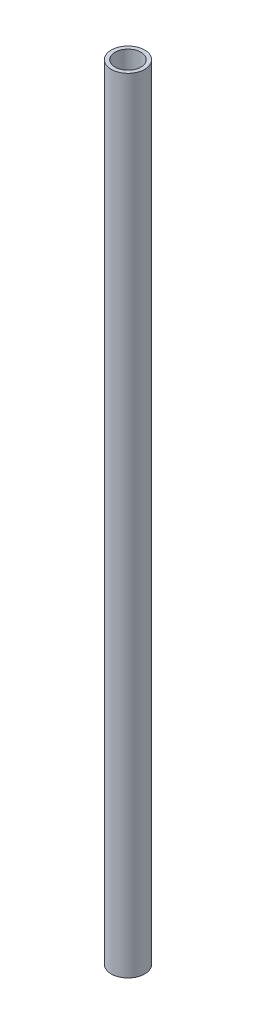
ISO-10303-21;
HEADER;
FILE_DESCRIPTION(('STEP AP214'),'2;1');
FILE_NAME('part.step','',(''),(''),'','','');
FILE_SCHEMA(('AUTOMOTIVE_DESIGN { 1 0 10303 214 1 1 1 1 }'));
ENDSEC;
DATA;
#1=APPLICATION_CONTEXT('core data for automotive mechanical design processes');
#2=APPLICATION_PROTOCOL_DEFINITION('international standard','automotive_design',2000,#1);
#3=PRODUCT_CONTEXT('',#1,'mechanical');
#4=PRODUCT('Part','Part','',(#3));
#5=PRODUCT_RELATED_PRODUCT_CATEGORY('part','',(#4));
#6=PRODUCT_DEFINITION_FORMATION('','',#4);
#7=PRODUCT_DEFINITION_CONTEXT('part definition',#1,'design');
#8=PRODUCT_DEFINITION('design','',#6,#7);
#9=PRODUCT_DEFINITION_SHAPE('','',#8);
#10=(LENGTH_UNIT() NAMED_UNIT(*) SI_UNIT(.MILLI.,.METRE.));
#11=(NAMED_UNIT(*) PLANE_ANGLE_UNIT() SI_UNIT($,.RADIAN.));
#12=(NAMED_UNIT(*) SI_UNIT($,.STERADIAN.) SOLID_ANGLE_UNIT());
#13=UNCERTAINTY_MEASURE_WITH_UNIT(LENGTH_MEASURE(1.E-05),#10,'distance_accuracy_value','');
#14=(GEOMETRIC_REPRESENTATION_CONTEXT(3) GLOBAL_UNCERTAINTY_ASSIGNED_CONTEXT((#13)) GLOBAL_UNIT_ASSIGNED_CONTEXT((#10,
#11,#12)) REPRESENTATION_CONTEXT('',''));
#15=CARTESIAN_POINT('',(0.,0.,0.));
#16=DIRECTION('',(0.,0.,1.));
#17=DIRECTION('',(1.,0.,0.));
#18=AXIS2_PLACEMENT_3D('',#15,#16,#17);
#19=CARTESIAN_POINT('',(0.,278.5,0.));
#20=DIRECTION('',(0.,1.,0.));
#21=DIRECTION('',(0.,0.,1.));
#22=AXIS2_PLACEMENT_3D('',#19,#20,#21);
#23=PLANE('',#22);
#24=CARTESIAN_POINT('',(0.,278.5,0.));
#25=DIRECTION('',(0.,1.,0.));
#26=DIRECTION('',(0.,0.,1.));
#27=AXIS2_PLACEMENT_3D('',#24,#25,#26);
#28=CIRCLE('',#27,5.95);
#29=CARTESIAN_POINT('',(0.,278.5,5.95));
#30=VERTEX_POINT('',#29);
#31=EDGE_CURVE('E10',#30,#30,#28,.T.);
#32=ORIENTED_EDGE('',*,*,#31,.T.);
#33=EDGE_LOOP('',(#32));
#34=FACE_BOUND('',#33,.T.);
#35=CARTESIAN_POINT('',(0.,278.5,0.));
#36=DIRECTION('',(0.,1.,0.));
#37=DIRECTION('',(0.,0.,1.));
#38=AXIS2_PLACEMENT_3D('',#35,#36,#37);
#39=CIRCLE('',#38,4.6);
#40=CARTESIAN_POINT('',(0.,278.5,4.6));
#41=VERTEX_POINT('',#40);
#42=EDGE_CURVE('E45',#41,#41,#39,.T.);
#43=ORIENTED_EDGE('',*,*,#42,.F.);
#44=EDGE_LOOP('',(#43));
#45=FACE_BOUND('',#44,.T.);
#46=ADVANCED_FACE('F34',(#34,#45),#23,.T.);
#47=CARTESIAN_POINT('',(0.,0.,0.));
#48=DIRECTION('',(0.,1.,0.));
#49=DIRECTION('',(0.,0.,1.));
#50=AXIS2_PLACEMENT_3D('',#47,#48,#49);
#51=PLANE('',#50);
#52=CARTESIAN_POINT('',(0.,0.,0.));
#53=DIRECTION('',(0.,1.,0.));
#54=DIRECTION('',(0.,0.,1.));
#55=AXIS2_PLACEMENT_3D('',#52,#53,#54);
#56=CIRCLE('',#55,5.95);
#57=CARTESIAN_POINT('',(0.,0.,5.95));
#58=VERTEX_POINT('',#57);
#59=EDGE_CURVE('E38',#58,#58,#56,.T.);
#60=ORIENTED_EDGE('',*,*,#59,.F.);
#61=EDGE_LOOP('',(#60));
#62=FACE_BOUND('',#61,.T.);
#63=CARTESIAN_POINT('',(0.,0.,0.));
#64=DIRECTION('',(0.,1.,0.));
#65=DIRECTION('',(0.,0.,1.));
#66=AXIS2_PLACEMENT_3D('',#63,#64,#65);
#67=CIRCLE('',#66,4.6);
#68=CARTESIAN_POINT('',(0.,0.,4.6));
#69=VERTEX_POINT('',#68);
#70=EDGE_CURVE('E47',#69,#69,#67,.T.);
#71=ORIENTED_EDGE('',*,*,#70,.T.);
#72=EDGE_LOOP('',(#71));
#73=FACE_BOUND('',#72,.T.);
#74=ADVANCED_FACE('F57',(#62,#73),#51,.F.);
#75=CARTESIAN_POINT('',(0.,278.5,0.));
#76=DIRECTION('',(0.,-1.,0.));
#77=DIRECTION('',(0.,0.,-1.));
#78=AXIS2_PLACEMENT_3D('',#75,#76,#77);
#79=CYLINDRICAL_SURFACE('',#78,5.95);
#80=ORIENTED_EDGE('',*,*,#31,.F.);
#81=EDGE_LOOP('',(#80));
#82=FACE_BOUND('',#81,.T.);
#83=ORIENTED_EDGE('',*,*,#59,.T.);
#84=EDGE_LOOP('',(#83));
#85=FACE_BOUND('',#84,.T.);
#86=ADVANCED_FACE('F36',(#82,#85),#79,.T.);
#87=CARTESIAN_POINT('',(0.,278.5,0.));
#88=DIRECTION('',(0.,-1.,0.));
#89=DIRECTION('',(0.,0.,-1.));
#90=AXIS2_PLACEMENT_3D('',#87,#88,#89);
#91=CYLINDRICAL_SURFACE('',#90,4.6);
#92=ORIENTED_EDGE('',*,*,#42,.T.);
#93=EDGE_LOOP('',(#92));
#94=FACE_BOUND('',#93,.T.);
#95=ORIENTED_EDGE('',*,*,#70,.F.);
#96=EDGE_LOOP('',(#95));
#97=FACE_BOUND('',#96,.T.);
#98=ADVANCED_FACE('F53',(#94,#97),#91,.F.);
#99=CLOSED_SHELL('',(#46,#74,#86,#98));
#100=MANIFOLD_SOLID_BREP('B2',#99);
#101=ADVANCED_BREP_SHAPE_REPRESENTATION('',(#18,#100),#14);
#102=SHAPE_DEFINITION_REPRESENTATION(#9,#101);
ENDSEC;
END-ISO-10303-21;
